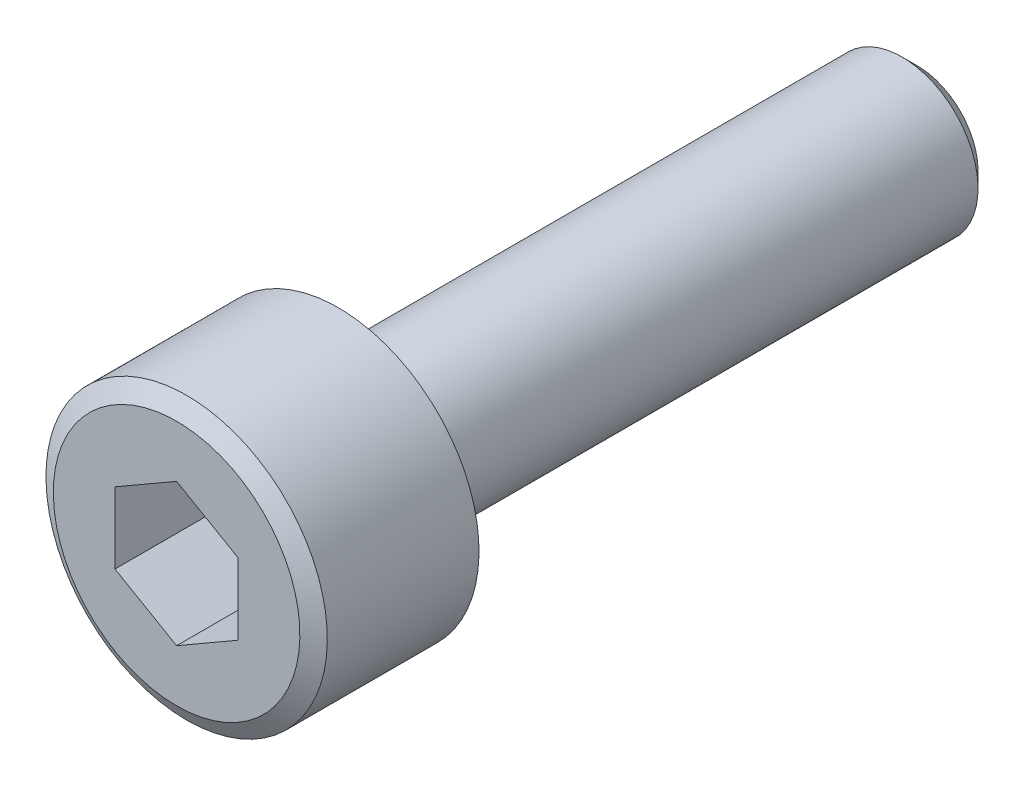
ISO-10303-21;
HEADER;
FILE_DESCRIPTION(('STEP AP214'),'2;1');
FILE_NAME('part.step','',(''),(''),'','','');
FILE_SCHEMA(('AUTOMOTIVE_DESIGN { 1 0 10303 214 1 1 1 1 }'));
ENDSEC;
DATA;
#1=APPLICATION_CONTEXT('core data for automotive mechanical design processes');
#2=APPLICATION_PROTOCOL_DEFINITION('international standard','automotive_design',2000,#1);
#3=PRODUCT_CONTEXT('',#1,'mechanical');
#4=PRODUCT('Part','Part','',(#3));
#5=PRODUCT_RELATED_PRODUCT_CATEGORY('part','',(#4));
#6=PRODUCT_DEFINITION_FORMATION('','',#4);
#7=PRODUCT_DEFINITION_CONTEXT('part definition',#1,'design');
#8=PRODUCT_DEFINITION('design','',#6,#7);
#9=PRODUCT_DEFINITION_SHAPE('','',#8);
#10=(LENGTH_UNIT() NAMED_UNIT(*) SI_UNIT(.MILLI.,.METRE.));
#11=(NAMED_UNIT(*) PLANE_ANGLE_UNIT() SI_UNIT($,.RADIAN.));
#12=(NAMED_UNIT(*) SI_UNIT($,.STERADIAN.) SOLID_ANGLE_UNIT());
#13=UNCERTAINTY_MEASURE_WITH_UNIT(LENGTH_MEASURE(1.E-05),#10,'distance_accuracy_value','');
#14=(GEOMETRIC_REPRESENTATION_CONTEXT(3) GLOBAL_UNCERTAINTY_ASSIGNED_CONTEXT((#13)) GLOBAL_UNIT_ASSIGNED_CONTEXT((#10,
#11,#12)) REPRESENTATION_CONTEXT('',''));
#15=CARTESIAN_POINT('',(0.,0.,0.));
#16=DIRECTION('',(0.,0.,1.));
#17=DIRECTION('',(1.,0.,0.));
#18=AXIS2_PLACEMENT_3D('',#15,#16,#17);
#19=CARTESIAN_POINT('',(0.,0.,0.));
#20=DIRECTION('',(0.,0.,-1.));
#21=DIRECTION('',(0.,1.,0.));
#22=AXIS2_PLACEMENT_3D('',#19,#20,#21);
#23=PLANE('',#22);
#24=DIRECTION('',(0.,-1.,0.));
#25=VECTOR('',#24,1.);
#26=CARTESIAN_POINT('',(-3.25,1.87638837486628,0.));
#27=LINE('',#26,#25);
#28=CARTESIAN_POINT('',(-3.25,1.87638837486628,0.));
#29=VERTEX_POINT('',#28);
#30=CARTESIAN_POINT('',(-3.25,-1.87638837486628,0.));
#31=VERTEX_POINT('',#30);
#32=EDGE_CURVE('E243',#29,#31,#27,.T.);
#33=ORIENTED_EDGE('',*,*,#32,.F.);
#34=DIRECTION('',(-0.866025403784439,-0.5,0.));
#35=VECTOR('',#34,1.);
#36=CARTESIAN_POINT('',(0.,3.75277674973257,0.));
#37=LINE('',#36,#35);
#38=CARTESIAN_POINT('',(0.,3.75277674973257,0.));
#39=VERTEX_POINT('',#38);
#40=EDGE_CURVE('E55',#39,#29,#37,.T.);
#41=ORIENTED_EDGE('',*,*,#40,.F.);
#42=DIRECTION('',(-0.866025403784439,0.5,0.));
#43=VECTOR('',#42,1.);
#44=CARTESIAN_POINT('',(3.25,1.87638837486628,0.));
#45=LINE('',#44,#43);
#46=CARTESIAN_POINT('',(3.25,1.87638837486628,0.));
#47=VERTEX_POINT('',#46);
#48=EDGE_CURVE('E90',#47,#39,#45,.T.);
#49=ORIENTED_EDGE('',*,*,#48,.F.);
#50=DIRECTION('',(0.,1.,0.));
#51=VECTOR('',#50,1.);
#52=CARTESIAN_POINT('',(3.25,-1.87638837486628,0.));
#53=LINE('',#52,#51);
#54=CARTESIAN_POINT('',(3.25,-1.87638837486628,0.));
#55=VERTEX_POINT('',#54);
#56=EDGE_CURVE('E100',#55,#47,#53,.T.);
#57=ORIENTED_EDGE('',*,*,#56,.F.);
#58=DIRECTION('',(0.866025403784438,0.5,0.));
#59=VECTOR('',#58,1.);
#60=CARTESIAN_POINT('',(0.,-3.75277674973257,0.));
#61=LINE('',#60,#59);
#62=CARTESIAN_POINT('',(0.,-3.75277674973257,0.));
#63=VERTEX_POINT('',#62);
#64=EDGE_CURVE('E106',#63,#55,#61,.T.);
#65=ORIENTED_EDGE('',*,*,#64,.F.);
#66=DIRECTION('',(0.866025403784439,-0.5,0.));
#67=VECTOR('',#66,1.);
#68=CARTESIAN_POINT('',(-3.25,-1.87638837486628,0.));
#69=LINE('',#68,#67);
#70=EDGE_CURVE('E246',#31,#63,#69,.T.);
#71=ORIENTED_EDGE('',*,*,#70,.F.);
#72=EDGE_LOOP('',(#33,#41,#49,#57,#65,#71));
#73=FACE_BOUND('',#72,.T.);
#74=CARTESIAN_POINT('',(0.,0.,0.));
#75=DIRECTION('',(0.,0.,1.));
#76=DIRECTION('',(0.,-1.,0.));
#77=AXIS2_PLACEMENT_3D('',#74,#75,#76);
#78=CIRCLE('',#77,6.5);
#79=CARTESIAN_POINT('',(0.,-6.5,0.));
#80=VERTEX_POINT('',#79);
#81=EDGE_CURVE('E137',#80,#80,#78,.T.);
#82=ORIENTED_EDGE('',*,*,#81,.T.);
#83=EDGE_LOOP('',(#82));
#84=FACE_BOUND('',#83,.T.);
#85=ADVANCED_FACE('F39',(#73,#84),#23,.F.);
#86=CARTESIAN_POINT('',(0.,0.,-0.53));
#87=DIRECTION('',(0.,0.,-1.));
#88=DIRECTION('',(0.,1.,0.));
#89=AXIS2_PLACEMENT_3D('',#86,#87,#88);
#90=CONICAL_SURFACE('',#89,7.4179869280115,1.0471975511966);
#91=ORIENTED_EDGE('',*,*,#81,.F.);
#92=EDGE_LOOP('',(#91));
#93=FACE_BOUND('',#92,.T.);
#94=CARTESIAN_POINT('',(0.,0.,-0.53));
#95=DIRECTION('',(0.,0.,1.));
#96=DIRECTION('',(0.,-1.,0.));
#97=AXIS2_PLACEMENT_3D('',#94,#95,#96);
#98=CIRCLE('',#97,7.4179869280115);
#99=CARTESIAN_POINT('',(0.,-7.4179869280115,-0.53));
#100=VERTEX_POINT('',#99);
#101=EDGE_CURVE('E134',#100,#100,#98,.T.);
#102=ORIENTED_EDGE('',*,*,#101,.T.);
#103=EDGE_LOOP('',(#102));
#104=FACE_BOUND('',#103,.T.);
#105=ADVANCED_FACE('F158',(#93,#104),#90,.T.);
#106=CARTESIAN_POINT('',(0.,0.,0.));
#107=DIRECTION('',(0.,0.,1.));
#108=DIRECTION('',(0.,-1.,0.));
#109=AXIS2_PLACEMENT_3D('',#106,#107,#108);
#110=CYLINDRICAL_SURFACE('',#109,7.4179869280115);
#111=ORIENTED_EDGE('',*,*,#101,.F.);
#112=EDGE_LOOP('',(#111));
#113=FACE_BOUND('',#112,.T.);
#114=CARTESIAN_POINT('',(0.,0.,-8.53));
#115=DIRECTION('',(0.,0.,1.));
#116=DIRECTION('',(0.,-1.,0.));
#117=AXIS2_PLACEMENT_3D('',#114,#115,#116);
#118=CIRCLE('',#117,7.4179869280115);
#119=CARTESIAN_POINT('',(0.,-7.4179869280115,-8.53));
#120=VERTEX_POINT('',#119);
#121=EDGE_CURVE('E131',#120,#120,#118,.T.);
#122=ORIENTED_EDGE('',*,*,#121,.T.);
#123=EDGE_LOOP('',(#122));
#124=FACE_BOUND('',#123,.T.);
#125=ADVANCED_FACE('F162',(#113,#124),#110,.T.);
#126=CARTESIAN_POINT('',(0.,0.,-9.06));
#127=DIRECTION('',(0.,0.,1.));
#128=DIRECTION('',(0.,-1.,0.));
#129=AXIS2_PLACEMENT_3D('',#126,#127,#128);
#130=CONICAL_SURFACE('',#129,6.5,1.0471975511966);
#131=ORIENTED_EDGE('',*,*,#121,.F.);
#132=EDGE_LOOP('',(#131));
#133=FACE_BOUND('',#132,.T.);
#134=CARTESIAN_POINT('',(0.,0.,-9.06));
#135=DIRECTION('',(0.,0.,1.));
#136=DIRECTION('',(0.,-1.,0.));
#137=AXIS2_PLACEMENT_3D('',#134,#135,#136);
#138=CIRCLE('',#137,6.5);
#139=CARTESIAN_POINT('',(0.,-6.5,-9.06));
#140=VERTEX_POINT('',#139);
#141=EDGE_CURVE('E128',#140,#140,#138,.T.);
#142=ORIENTED_EDGE('',*,*,#141,.T.);
#143=EDGE_LOOP('',(#142));
#144=FACE_BOUND('',#143,.T.);
#145=ADVANCED_FACE('F168',(#133,#144),#130,.T.);
#146=CARTESIAN_POINT('',(0.,6.5,-9.06));
#147=DIRECTION('',(0.,0.,1.));
#148=DIRECTION('',(0.,-1.,0.));
#149=AXIS2_PLACEMENT_3D('',#146,#147,#148);
#150=PLANE('',#149);
#151=ORIENTED_EDGE('',*,*,#141,.F.);
#152=EDGE_LOOP('',(#151));
#153=FACE_BOUND('',#152,.T.);
#154=CARTESIAN_POINT('',(0.,0.,-9.06));
#155=DIRECTION('',(0.,0.,1.));
#156=DIRECTION('',(0.,-1.,0.));
#157=AXIS2_PLACEMENT_3D('',#154,#155,#156);
#158=CIRCLE('',#157,4.);
#159=CARTESIAN_POINT('',(0.,-4.,-9.06));
#160=VERTEX_POINT('',#159);
#161=EDGE_CURVE('E117',#160,#160,#158,.T.);
#162=ORIENTED_EDGE('',*,*,#161,.T.);
#163=EDGE_LOOP('',(#162));
#164=FACE_BOUND('',#163,.T.);
#165=ADVANCED_FACE('F172',(#153,#164),#150,.F.);
#166=CARTESIAN_POINT('',(0.,0.,0.));
#167=DIRECTION('',(0.,0.,1.));
#168=DIRECTION('',(0.,-1.,0.));
#169=AXIS2_PLACEMENT_3D('',#166,#167,#168);
#170=CYLINDRICAL_SURFACE('',#169,4.);
#171=CARTESIAN_POINT('',(0.,0.,-38.26));
#172=DIRECTION('',(0.,0.,1.));
#173=DIRECTION('',(0.,-1.,0.));
#174=AXIS2_PLACEMENT_3D('',#171,#172,#173);
#175=CIRCLE('',#174,4.);
#176=CARTESIAN_POINT('',(0.,-4.,-38.26));
#177=VERTEX_POINT('',#176);
#178=EDGE_CURVE('E48',#177,#177,#175,.T.);
#179=ORIENTED_EDGE('',*,*,#178,.T.);
#180=EDGE_LOOP('',(#179));
#181=FACE_BOUND('',#180,.T.);
#182=ORIENTED_EDGE('',*,*,#161,.F.);
#183=EDGE_LOOP('',(#182));
#184=FACE_BOUND('',#183,.T.);
#185=ADVANCED_FACE('F142',(#181,#184),#170,.T.);
#186=CARTESIAN_POINT('',(0.,4.,-39.06));
#187=DIRECTION('',(0.,0.,1.));
#188=DIRECTION('',(0.,-1.,0.));
#189=AXIS2_PLACEMENT_3D('',#186,#187,#188);
#190=PLANE('',#189);
#191=CARTESIAN_POINT('',(0.,0.,-39.06));
#192=DIRECTION('',(0.,0.,1.));
#193=DIRECTION('',(0.,-1.,0.));
#194=AXIS2_PLACEMENT_3D('',#191,#192,#193);
#195=CIRCLE('',#194,3.19999999999999);
#196=CARTESIAN_POINT('',(0.,-3.19999999999999,-39.06));
#197=VERTEX_POINT('',#196);
#198=EDGE_CURVE('E11',#197,#197,#195,.F.);
#199=ORIENTED_EDGE('',*,*,#198,.T.);
#200=EDGE_LOOP('',(#199));
#201=FACE_BOUND('',#200,.T.);
#202=ADVANCED_FACE('F147',(#201),#190,.F.);
#203=CARTESIAN_POINT('',(0.,0.,-38.26));
#204=DIRECTION('',(0.,0.,1.));
#205=DIRECTION('',(0.,-1.,0.));
#206=AXIS2_PLACEMENT_3D('',#203,#204,#205);
#207=CONICAL_SURFACE('',#206,4.,0.78539816339745);
#208=ORIENTED_EDGE('',*,*,#198,.F.);
#209=EDGE_LOOP('',(#208));
#210=FACE_BOUND('',#209,.T.);
#211=ORIENTED_EDGE('',*,*,#178,.F.);
#212=EDGE_LOOP('',(#211));
#213=FACE_BOUND('',#212,.T.);
#214=ADVANCED_FACE('F42',(#210,#213),#207,.T.);
#215=CARTESIAN_POINT('',(0.,3.75277674973257,-6.));
#216=DIRECTION('',(-0.5,0.866025403784439,0.));
#217=DIRECTION('',(-0.866025403784439,-0.5,0.));
#218=AXIS2_PLACEMENT_3D('',#215,#216,#217);
#219=PLANE('',#218);
#220=ORIENTED_EDGE('',*,*,#40,.T.);
#221=DIRECTION('',(0.,0.,1.));
#222=VECTOR('',#221,1.);
#223=CARTESIAN_POINT('',(-3.25,1.87638837486628,-6.));
#224=LINE('',#223,#222);
#225=CARTESIAN_POINT('',(-3.25,1.87638837486628,-6.));
#226=VERTEX_POINT('',#225);
#227=EDGE_CURVE('E124',#226,#29,#224,.T.);
#228=ORIENTED_EDGE('',*,*,#227,.F.);
#229=DIRECTION('',(-0.866025403784439,-0.5,0.));
#230=VECTOR('',#229,1.);
#231=CARTESIAN_POINT('',(0.,3.75277674973257,-6.));
#232=LINE('',#231,#230);
#233=CARTESIAN_POINT('',(0.,3.75277674973257,-6.));
#234=VERTEX_POINT('',#233);
#235=EDGE_CURVE('E110',#234,#226,#232,.T.);
#236=ORIENTED_EDGE('',*,*,#235,.F.);
#237=DIRECTION('',(0.,0.,1.));
#238=VECTOR('',#237,1.);
#239=CARTESIAN_POINT('',(0.,3.75277674973257,-6.));
#240=LINE('',#239,#238);
#241=EDGE_CURVE('E96',#234,#39,#240,.T.);
#242=ORIENTED_EDGE('',*,*,#241,.T.);
#243=EDGE_LOOP('',(#220,#228,#236,#242));
#244=FACE_BOUND('',#243,.T.);
#245=ADVANCED_FACE('F146',(#244),#219,.F.);
#246=CARTESIAN_POINT('',(3.25,1.87638837486628,-6.));
#247=DIRECTION('',(0.5,0.866025403784439,0.));
#248=DIRECTION('',(-0.866025403784439,0.5,0.));
#249=AXIS2_PLACEMENT_3D('',#246,#247,#248);
#250=PLANE('',#249);
#251=ORIENTED_EDGE('',*,*,#48,.T.);
#252=ORIENTED_EDGE('',*,*,#241,.F.);
#253=DIRECTION('',(-0.866025403784439,0.5,0.));
#254=VECTOR('',#253,1.);
#255=CARTESIAN_POINT('',(3.25,1.87638837486628,-6.));
#256=LINE('',#255,#254);
#257=CARTESIAN_POINT('',(3.25,1.87638837486628,-6.));
#258=VERTEX_POINT('',#257);
#259=EDGE_CURVE('E93',#258,#234,#256,.T.);
#260=ORIENTED_EDGE('',*,*,#259,.F.);
#261=DIRECTION('',(0.,0.,1.));
#262=VECTOR('',#261,1.);
#263=CARTESIAN_POINT('',(3.25,1.87638837486628,-6.));
#264=LINE('',#263,#262);
#265=EDGE_CURVE('E85',#258,#47,#264,.T.);
#266=ORIENTED_EDGE('',*,*,#265,.T.);
#267=EDGE_LOOP('',(#251,#252,#260,#266));
#268=FACE_BOUND('',#267,.T.);
#269=ADVANCED_FACE('F87',(#268),#250,.F.);
#270=CARTESIAN_POINT('',(3.25,-1.87638837486628,-6.));
#271=DIRECTION('',(1.,0.,0.));
#272=DIRECTION('',(0.,0.,-1.));
#273=AXIS2_PLACEMENT_3D('',#270,#271,#272);
#274=PLANE('',#273);
#275=ORIENTED_EDGE('',*,*,#56,.T.);
#276=ORIENTED_EDGE('',*,*,#265,.F.);
#277=DIRECTION('',(0.,1.,0.));
#278=VECTOR('',#277,1.);
#279=CARTESIAN_POINT('',(3.25,-1.87638837486628,-6.));
#280=LINE('',#279,#278);
#281=CARTESIAN_POINT('',(3.25,-1.87638837486628,-6.));
#282=VERTEX_POINT('',#281);
#283=EDGE_CURVE('E238',#282,#258,#280,.T.);
#284=ORIENTED_EDGE('',*,*,#283,.F.);
#285=DIRECTION('',(0.,0.,1.));
#286=VECTOR('',#285,1.);
#287=CARTESIAN_POINT('',(3.25,-1.87638837486628,-6.));
#288=LINE('',#287,#286);
#289=EDGE_CURVE('E97',#282,#55,#288,.T.);
#290=ORIENTED_EDGE('',*,*,#289,.T.);
#291=EDGE_LOOP('',(#275,#276,#284,#290));
#292=FACE_BOUND('',#291,.T.);
#293=ADVANCED_FACE('F101',(#292),#274,.F.);
#294=CARTESIAN_POINT('',(0.,-3.75277674973257,-6.));
#295=DIRECTION('',(0.5,-0.866025403784438,0.));
#296=DIRECTION('',(0.866025403784439,0.5,0.));
#297=AXIS2_PLACEMENT_3D('',#294,#295,#296);
#298=PLANE('',#297);
#299=ORIENTED_EDGE('',*,*,#64,.T.);
#300=ORIENTED_EDGE('',*,*,#289,.F.);
#301=DIRECTION('',(0.866025403784438,0.5,0.));
#302=VECTOR('',#301,1.);
#303=CARTESIAN_POINT('',(0.,-3.75277674973257,-6.));
#304=LINE('',#303,#302);
#305=CARTESIAN_POINT('',(0.,-3.75277674973257,-6.));
#306=VERTEX_POINT('',#305);
#307=EDGE_CURVE('E233',#306,#282,#304,.T.);
#308=ORIENTED_EDGE('',*,*,#307,.F.);
#309=DIRECTION('',(0.,0.,1.));
#310=VECTOR('',#309,1.);
#311=CARTESIAN_POINT('',(0.,-3.75277674973257,-6.));
#312=LINE('',#311,#310);
#313=EDGE_CURVE('E120',#306,#63,#312,.T.);
#314=ORIENTED_EDGE('',*,*,#313,.T.);
#315=EDGE_LOOP('',(#299,#300,#308,#314));
#316=FACE_BOUND('',#315,.T.);
#317=ADVANCED_FACE('F187',(#316),#298,.F.);
#318=CARTESIAN_POINT('',(-3.25,-1.87638837486628,-6.));
#319=DIRECTION('',(-0.5,-0.866025403784439,0.));
#320=DIRECTION('',(0.866025403784439,-0.5,0.));
#321=AXIS2_PLACEMENT_3D('',#318,#319,#320);
#322=PLANE('',#321);
#323=ORIENTED_EDGE('',*,*,#70,.T.);
#324=ORIENTED_EDGE('',*,*,#313,.F.);
#325=DIRECTION('',(0.866025403784439,-0.5,0.));
#326=VECTOR('',#325,1.);
#327=CARTESIAN_POINT('',(-3.25,-1.87638837486628,-6.));
#328=LINE('',#327,#326);
#329=CARTESIAN_POINT('',(-3.25,-1.87638837486628,-6.));
#330=VERTEX_POINT('',#329);
#331=EDGE_CURVE('E230',#330,#306,#328,.T.);
#332=ORIENTED_EDGE('',*,*,#331,.F.);
#333=DIRECTION('',(0.,0.,1.));
#334=VECTOR('',#333,1.);
#335=CARTESIAN_POINT('',(-3.25,-1.87638837486628,-6.));
#336=LINE('',#335,#334);
#337=EDGE_CURVE('E122',#330,#31,#336,.T.);
#338=ORIENTED_EDGE('',*,*,#337,.T.);
#339=EDGE_LOOP('',(#323,#324,#332,#338));
#340=FACE_BOUND('',#339,.T.);
#341=ADVANCED_FACE('F183',(#340),#322,.F.);
#342=CARTESIAN_POINT('',(-3.25,1.87638837486628,-6.));
#343=DIRECTION('',(-1.,0.,0.));
#344=DIRECTION('',(0.,0.,1.));
#345=AXIS2_PLACEMENT_3D('',#342,#343,#344);
#346=PLANE('',#345);
#347=ORIENTED_EDGE('',*,*,#32,.T.);
#348=ORIENTED_EDGE('',*,*,#337,.F.);
#349=DIRECTION('',(0.,-1.,0.));
#350=VECTOR('',#349,1.);
#351=CARTESIAN_POINT('',(-3.25,1.87638837486628,-6.));
#352=LINE('',#351,#350);
#353=EDGE_CURVE('E113',#226,#330,#352,.T.);
#354=ORIENTED_EDGE('',*,*,#353,.F.);
#355=ORIENTED_EDGE('',*,*,#227,.T.);
#356=EDGE_LOOP('',(#347,#348,#354,#355));
#357=FACE_BOUND('',#356,.T.);
#358=ADVANCED_FACE('F179',(#357),#346,.F.);
#359=CARTESIAN_POINT('',(0.,0.,-6.));
#360=DIRECTION('',(0.,0.,1.));
#361=DIRECTION('',(1.,0.,0.));
#362=AXIS2_PLACEMENT_3D('',#359,#360,#361);
#363=PLANE('',#362);
#364=CARTESIAN_POINT('',(0.,0.,-6.));
#365=DIRECTION('',(0.,0.,1.));
#366=DIRECTION('',(1.,0.,0.));
#367=AXIS2_PLACEMENT_3D('',#364,#365,#366);
#368=CIRCLE('',#367,3.75277674973257);
#369=EDGE_CURVE('E64',#234,#226,#368,.T.);
#370=ORIENTED_EDGE('',*,*,#369,.F.);
#371=ORIENTED_EDGE('',*,*,#235,.T.);
#372=EDGE_LOOP('',(#370,#371));
#373=FACE_BOUND('',#372,.T.);
#374=ADVANCED_FACE('F182',(#373),#363,.F.);
#375=EDGE_CURVE('E244',#258,#234,#368,.T.);
#376=ORIENTED_EDGE('',*,*,#375,.F.);
#377=ORIENTED_EDGE('',*,*,#259,.T.);
#378=EDGE_LOOP('',(#376,#377));
#379=FACE_BOUND('',#378,.T.);
#380=ADVANCED_FACE('F202',(#379),#363,.F.);
#381=EDGE_CURVE('E259',#282,#258,#368,.T.);
#382=ORIENTED_EDGE('',*,*,#381,.F.);
#383=ORIENTED_EDGE('',*,*,#283,.T.);
#384=EDGE_LOOP('',(#382,#383));
#385=FACE_BOUND('',#384,.T.);
#386=ADVANCED_FACE('F207',(#385),#363,.F.);
#387=EDGE_CURVE('E256',#306,#282,#368,.T.);
#388=ORIENTED_EDGE('',*,*,#387,.F.);
#389=ORIENTED_EDGE('',*,*,#307,.T.);
#390=EDGE_LOOP('',(#388,#389));
#391=FACE_BOUND('',#390,.T.);
#392=ADVANCED_FACE('F215',(#391),#363,.F.);
#393=EDGE_CURVE('E224',#330,#306,#368,.T.);
#394=ORIENTED_EDGE('',*,*,#393,.F.);
#395=ORIENTED_EDGE('',*,*,#331,.T.);
#396=EDGE_LOOP('',(#394,#395));
#397=FACE_BOUND('',#396,.T.);
#398=ADVANCED_FACE('F210',(#397),#363,.F.);
#399=EDGE_CURVE('E218',#226,#330,#368,.T.);
#400=ORIENTED_EDGE('',*,*,#399,.F.);
#401=ORIENTED_EDGE('',*,*,#353,.T.);
#402=EDGE_LOOP('',(#400,#401));
#403=FACE_BOUND('',#402,.T.);
#404=ADVANCED_FACE('F199',(#403),#363,.F.);
#405=CARTESIAN_POINT('',(0.,0.,-6.));
#406=DIRECTION('',(0.,0.,1.));
#407=DIRECTION('',(1.,0.,0.));
#408=AXIS2_PLACEMENT_3D('',#405,#406,#407);
#409=CONICAL_SURFACE('',#408,3.75277674973257,1.0471975511966);
#410=CARTESIAN_POINT('',(0.,0.,-8.16666666666664));
#411=VERTEX_POINT('',#410);
#412=VERTEX_LOOP('',#411);
#413=FACE_BOUND('',#412,.T.);
#414=ORIENTED_EDGE('',*,*,#375,.T.);
#415=ORIENTED_EDGE('',*,*,#369,.T.);
#416=ORIENTED_EDGE('',*,*,#399,.T.);
#417=ORIENTED_EDGE('',*,*,#393,.T.);
#418=ORIENTED_EDGE('',*,*,#387,.T.);
#419=ORIENTED_EDGE('',*,*,#381,.T.);
#420=EDGE_LOOP('',(#414,#415,#416,#417,#418,#419));
#421=FACE_BOUND('',#420,.T.);
#422=ADVANCED_FACE('F196',(#413,#421),#409,.F.);
#423=CLOSED_SHELL('',(#85,#105,#125,#145,#165,#185,#202,#214,#245,#269,#293,#317,#341,#358,#374,
#380,#386,#392,#398,#404,#422));
#424=MANIFOLD_SOLID_BREP('B2',#423);
#425=ADVANCED_BREP_SHAPE_REPRESENTATION('',(#18,#424),#14);
#426=SHAPE_DEFINITION_REPRESENTATION(#9,#425);
ENDSEC;
END-ISO-10303-21;
